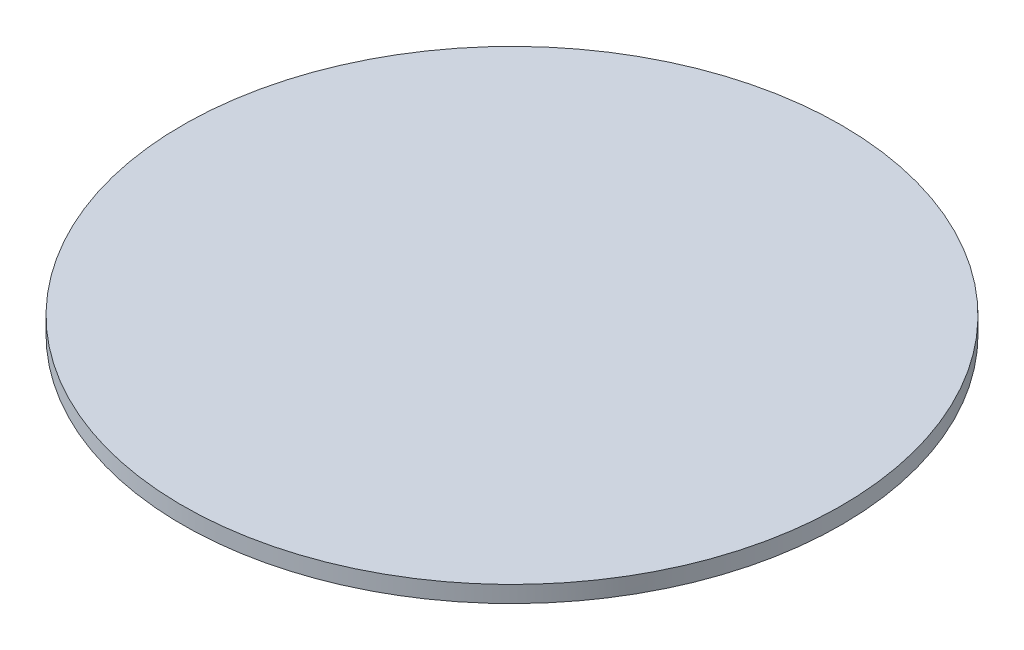
ISO-10303-21;
HEADER;
FILE_DESCRIPTION(('STEP AP214'),'2;1');
FILE_NAME('part.step','',(''),(''),'','','');
FILE_SCHEMA(('AUTOMOTIVE_DESIGN { 1 0 10303 214 1 1 1 1 }'));
ENDSEC;
DATA;
#1=APPLICATION_CONTEXT('core data for automotive mechanical design processes');
#2=APPLICATION_PROTOCOL_DEFINITION('international standard','automotive_design',2000,#1);
#3=PRODUCT_CONTEXT('',#1,'mechanical');
#4=PRODUCT('Part','Part','',(#3));
#5=PRODUCT_RELATED_PRODUCT_CATEGORY('part','',(#4));
#6=PRODUCT_DEFINITION_FORMATION('','',#4);
#7=PRODUCT_DEFINITION_CONTEXT('part definition',#1,'design');
#8=PRODUCT_DEFINITION('design','',#6,#7);
#9=PRODUCT_DEFINITION_SHAPE('','',#8);
#10=(LENGTH_UNIT() NAMED_UNIT(*) SI_UNIT(.MILLI.,.METRE.));
#11=(NAMED_UNIT(*) PLANE_ANGLE_UNIT() SI_UNIT($,.RADIAN.));
#12=(NAMED_UNIT(*) SI_UNIT($,.STERADIAN.) SOLID_ANGLE_UNIT());
#13=UNCERTAINTY_MEASURE_WITH_UNIT(LENGTH_MEASURE(1.E-05),#10,'distance_accuracy_value','');
#14=(GEOMETRIC_REPRESENTATION_CONTEXT(3) GLOBAL_UNCERTAINTY_ASSIGNED_CONTEXT((#13)) GLOBAL_UNIT_ASSIGNED_CONTEXT((#10,
#11,#12)) REPRESENTATION_CONTEXT('',''));
#15=CARTESIAN_POINT('',(0.,0.,0.));
#16=DIRECTION('',(0.,0.,1.));
#17=DIRECTION('',(1.,0.,0.));
#18=AXIS2_PLACEMENT_3D('',#15,#16,#17);
#19=CARTESIAN_POINT('',(21.2731331748166,3.24918533795984,102.377891347207));
#20=CARTESIAN_POINT('',(22.5518424825592,3.24918533795984,102.377891347207));
#21=CARTESIAN_POINT('',(25.1092610980446,3.24918533795984,102.629775095617));
#22=CARTESIAN_POINT('',(28.7979687765083,3.24918533795984,103.748732336676));
#23=CARTESIAN_POINT('',(32.1975012427753,3.24918533795984,105.565820296922));
#24=CARTESIAN_POINT('',(35.177216370647,3.24918533795984,108.011209305078));
#25=CARTESIAN_POINT('',(37.6226053788025,3.24918533795984,110.99092443295));
#26=CARTESIAN_POINT('',(39.4396933390486,3.24918533795984,114.390456899217));
#27=CARTESIAN_POINT('',(40.5586505801075,3.24918533795984,118.07916457768));
#28=CARTESIAN_POINT('',(40.9364762027238,3.24918533795984,121.915292500908));
#29=CARTESIAN_POINT('',(40.5586505801075,3.24918533795984,125.751420424136));
#30=CARTESIAN_POINT('',(39.4396933390486,3.24918533795984,129.4401281026));
#31=CARTESIAN_POINT('',(37.6226053788025,3.24918533795984,132.839660568867));
#32=CARTESIAN_POINT('',(35.177216370647,3.24918533795984,135.819375696739));
#33=CARTESIAN_POINT('',(32.1975012427753,3.24918533795984,138.264764704894));
#34=CARTESIAN_POINT('',(28.7979687765083,3.24918533795984,140.08185266514));
#35=CARTESIAN_POINT('',(25.1092610980446,3.24918533795984,141.200809906199));
#36=CARTESIAN_POINT('',(21.2731331748166,3.24918533795984,141.578635528816));
#37=CARTESIAN_POINT('',(17.4370052515886,3.24918533795984,141.200809906199));
#38=CARTESIAN_POINT('',(13.7482975731249,3.24918533795984,140.08185266514));
#39=CARTESIAN_POINT('',(10.3487651068578,3.24918533795984,138.264764704894));
#40=CARTESIAN_POINT('',(7.36904997898615,3.24918533795984,135.819375696739));
#41=CARTESIAN_POINT('',(4.92366097083058,3.24918533795984,132.839660568867));
#42=CARTESIAN_POINT('',(3.10657301058456,3.24918533795984,129.4401281026));
#43=CARTESIAN_POINT('',(1.98761576952567,3.24918533795984,125.751420424136));
#44=CARTESIAN_POINT('',(1.60979014690934,3.24918533795984,121.915292500908));
#45=CARTESIAN_POINT('',(1.98761576952566,3.24918533795984,118.07916457768));
#46=CARTESIAN_POINT('',(3.10657301058456,3.24918533795984,114.390456899217));
#47=CARTESIAN_POINT('',(4.92366097083058,3.24918533795984,110.99092443295));
#48=CARTESIAN_POINT('',(7.36904997898614,3.24918533795984,108.011209305078));
#49=CARTESIAN_POINT('',(10.3487651068578,3.24918533795984,105.565820296922));
#50=CARTESIAN_POINT('',(13.7482975731249,3.24918533795984,103.748732336676));
#51=CARTESIAN_POINT('',(17.4370052515886,3.24918533795984,102.629775095617));
#52=CARTESIAN_POINT('',(19.9944238670739,3.24918533795984,102.377891347207));
#53=CARTESIAN_POINT('',(21.2731331748166,3.24918533795984,102.377891347207));
#54=B_SPLINE_CURVE_WITH_KNOTS('',3,(#19,#20,#21,#22,#23,#24,#25,#26,#27,#28,#29,#30,#31,#32,#33,
#34,#35,#36,#37,#38,#39,#40,#41,#42,#43,#44,#45,#46,#47,#48,#49,#50,#51,#52,#53),.UNSPECIFIED.,
.T.,.F.,(4,1,1,1,1,1,1,1,1,1,1,1,1,1,1,1,1,1,1,1,1,1,1,1,1,1,1,1,1,1,1,1,4),(0.,
0.0312499999999999,0.0625,0.09375,0.125,0.15625,0.1875,0.21875,0.25,0.28125,0.3125,0.34375,
0.375,0.40625,0.4375,0.46875,0.5,0.53125,0.5625,0.59375,0.625,0.65625,0.6875,0.71875,0.75,
0.78125,0.8125,0.84375,0.875,0.90625,0.9375,0.96875,1.),.UNSPECIFIED.);
#55=DIRECTION('',(0.,-1.,0.));
#56=VECTOR('',#55,1.);
#57=SURFACE_OF_LINEAR_EXTRUSION('',#54,#56);
#58=CARTESIAN_POINT('',(21.2731331748166,3.24918533795984,102.377891347207));
#59=CARTESIAN_POINT('',(22.5518424825592,3.24918533795984,102.377891347207));
#60=CARTESIAN_POINT('',(25.1092610980446,3.24918533795984,102.629775095617));
#61=CARTESIAN_POINT('',(28.7979687765083,3.24918533795984,103.748732336676));
#62=CARTESIAN_POINT('',(32.1975012427753,3.24918533795984,105.565820296922));
#63=CARTESIAN_POINT('',(35.177216370647,3.24918533795984,108.011209305078));
#64=CARTESIAN_POINT('',(37.6226053788025,3.24918533795984,110.99092443295));
#65=CARTESIAN_POINT('',(39.4396933390486,3.24918533795984,114.390456899217));
#66=CARTESIAN_POINT('',(40.5586505801075,3.24918533795984,118.07916457768));
#67=CARTESIAN_POINT('',(40.9364762027238,3.24918533795984,121.915292500908));
#68=CARTESIAN_POINT('',(40.5586505801075,3.24918533795984,125.751420424136));
#69=CARTESIAN_POINT('',(39.4396933390486,3.24918533795984,129.4401281026));
#70=CARTESIAN_POINT('',(37.6226053788025,3.24918533795984,132.839660568867));
#71=CARTESIAN_POINT('',(35.177216370647,3.24918533795984,135.819375696739));
#72=CARTESIAN_POINT('',(32.1975012427753,3.24918533795984,138.264764704894));
#73=CARTESIAN_POINT('',(28.7979687765083,3.24918533795984,140.08185266514));
#74=CARTESIAN_POINT('',(25.1092610980446,3.24918533795984,141.200809906199));
#75=CARTESIAN_POINT('',(21.2731331748166,3.24918533795984,141.578635528816));
#76=CARTESIAN_POINT('',(17.4370052515886,3.24918533795984,141.200809906199));
#77=CARTESIAN_POINT('',(13.7482975731249,3.24918533795984,140.08185266514));
#78=CARTESIAN_POINT('',(10.3487651068578,3.24918533795984,138.264764704894));
#79=CARTESIAN_POINT('',(7.36904997898615,3.24918533795984,135.819375696739));
#80=CARTESIAN_POINT('',(4.92366097083058,3.24918533795984,132.839660568867));
#81=CARTESIAN_POINT('',(3.10657301058456,3.24918533795984,129.4401281026));
#82=CARTESIAN_POINT('',(1.98761576952567,3.24918533795984,125.751420424136));
#83=CARTESIAN_POINT('',(1.60979014690934,3.24918533795984,121.915292500908));
#84=CARTESIAN_POINT('',(1.98761576952566,3.24918533795984,118.07916457768));
#85=CARTESIAN_POINT('',(3.10657301058456,3.24918533795984,114.390456899217));
#86=CARTESIAN_POINT('',(4.92366097083058,3.24918533795984,110.99092443295));
#87=CARTESIAN_POINT('',(7.36904997898614,3.24918533795984,108.011209305078));
#88=CARTESIAN_POINT('',(10.3487651068578,3.24918533795984,105.565820296922));
#89=CARTESIAN_POINT('',(13.7482975731249,3.24918533795984,103.748732336676));
#90=CARTESIAN_POINT('',(17.4370052515886,3.24918533795984,102.629775095617));
#91=CARTESIAN_POINT('',(19.9944238670739,3.24918533795984,102.377891347207));
#92=CARTESIAN_POINT('',(21.2731331748166,3.24918533795984,102.377891347207));
#93=B_SPLINE_CURVE_WITH_KNOTS('',3,(#58,#59,#60,#61,#62,#63,#64,#65,#66,#67,#68,#69,#70,#71,#72,
#73,#74,#75,#76,#77,#78,#79,#80,#81,#82,#83,#84,#85,#86,#87,#88,#89,#90,#91,#92),.UNSPECIFIED.,
.T.,.F.,(4,1,1,1,1,1,1,1,1,1,1,1,1,1,1,1,1,1,1,1,1,1,1,1,1,1,1,1,1,1,1,1,4),(0.,
0.0312499999999999,0.0625,0.09375,0.125,0.15625,0.1875,0.21875,0.25,0.28125,0.3125,0.34375,
0.375,0.40625,0.4375,0.46875,0.5,0.53125,0.5625,0.59375,0.625,0.65625,0.6875,0.71875,0.75,
0.78125,0.8125,0.84375,0.875,0.90625,0.9375,0.96875,1.),.UNSPECIFIED.);
#94=CARTESIAN_POINT('',(21.2731331748166,3.24918533795984,102.377891347207));
#95=VERTEX_POINT('',#94);
#96=EDGE_CURVE('E9',#95,#95,#93,.T.);
#97=ORIENTED_EDGE('',*,*,#96,.T.);
#98=EDGE_LOOP('',(#97));
#99=FACE_BOUND('',#98,.T.);
#100=CARTESIAN_POINT('',(21.2731331748166,2.26610024094684,102.377891347207));
#101=CARTESIAN_POINT('',(20.9534538849464,2.26610024094684,102.377891413515));
#102=CARTESIAN_POINT('',(20.6337769216615,2.26610024094684,102.385762808348));
#103=CARTESIAN_POINT('',(19.9951907999093,2.26610024094684,102.417172587829));
#104=CARTESIAN_POINT('',(19.6762816474255,2.26610024094684,102.440711094176));
#105=CARTESIAN_POINT('',(19.0399992891781,2.26610024094684,102.503379427095));
#106=CARTESIAN_POINT('',(18.7226260834145,2.26610024094684,102.542509253668));
#107=CARTESIAN_POINT('',(18.0901818096652,2.26610024094684,102.636285079453));
#108=CARTESIAN_POINT('',(17.7751107238161,2.26610024094684,102.690930958136));
#109=CARTESIAN_POINT('',(17.1480398609491,2.26610024094684,102.815663105913));
#110=CARTESIAN_POINT('',(16.8360400839313,2.26610024094684,102.885749375006));
#111=CARTESIAN_POINT('',(16.2158512640616,2.26610024094684,103.041137771615));
#112=CARTESIAN_POINT('',(15.9076622508299,2.26610024094684,103.126440017321));
#113=CARTESIAN_POINT('',(15.2958320512569,2.26610024094684,103.31203667904));
#114=CARTESIAN_POINT('',(14.9921908649155,2.26610024094684,103.412331095052));
#115=CARTESIAN_POINT('',(14.3901935366709,2.26610024094684,103.627688814235));
#116=CARTESIAN_POINT('',(14.0918373537326,2.26610024094684,103.742752002677));
#117=CARTESIAN_POINT('',(13.501149529916,2.26610024094684,103.987422910405));
#118=CARTESIAN_POINT('',(13.2088178890376,2.26610024094684,104.11703062969));
#119=CARTESIAN_POINT('',(12.6308605921862,2.26610024094684,104.390426119311));
#120=CARTESIAN_POINT('',(12.3452349883222,2.26610024094684,104.534213999788));
#121=CARTESIAN_POINT('',(11.7813690479351,2.26610024094684,104.835606624106));
#122=CARTESIAN_POINT('',(11.503128711412,2.26610024094684,104.993211367947));
#123=CARTESIAN_POINT('',(10.9547127995542,2.26610024094684,105.321874901627));
#124=CARTESIAN_POINT('',(10.6845371615907,2.26610024094684,105.492933586949));
#125=CARTESIAN_POINT('',(10.1529321649234,2.26610024094684,105.848140689533));
#126=CARTESIAN_POINT('',(9.89150280621962,2.26610024094684,106.032289106795));
#127=CARTESIAN_POINT('',(9.37798761085564,2.26610024094684,106.413185253903));
#128=CARTESIAN_POINT('',(9.12590184679061,2.26610024094684,106.609933081608));
#129=CARTESIAN_POINT('',(8.63166921647461,2.26610024094684,107.015539319044));
#130=CARTESIAN_POINT('',(8.38952235022364,2.26610024094684,107.224397728775));
#131=CARTESIAN_POINT('',(7.91576317095395,2.26610024094684,107.653736721657));
#132=CARTESIAN_POINT('',(7.68415077611925,2.26610024094684,107.874217214517));
#133=CARTESIAN_POINT('',(7.23205788842505,2.26610024094684,108.326310102211));
#134=CARTESIAN_POINT('',(7.01157739556555,2.26610024094684,108.557922497046));
#135=CARTESIAN_POINT('',(6.5822384026831,2.26610024094684,109.031681676315));
#136=CARTESIAN_POINT('',(6.37337999295179,2.26610024094684,109.273828542566));
#137=CARTESIAN_POINT('',(5.967773755516,2.26610024094684,109.768061172882));
#138=CARTESIAN_POINT('',(5.77102592781153,2.26610024094684,110.020146936947));
#139=CARTESIAN_POINT('',(5.39012978070341,2.26610024094684,110.533662132311));
#140=CARTESIAN_POINT('',(5.20598136344083,2.26610024094684,110.795091491015));
#141=CARTESIAN_POINT('',(4.85077426085684,2.26610024094684,111.326696487682));
#142=CARTESIAN_POINT('',(4.67971557553542,2.26610024094684,111.596872125645));
#143=CARTESIAN_POINT('',(4.35105204185499,2.26610024094684,112.145288037504));
#144=CARTESIAN_POINT('',(4.19344729801418,2.26610024094684,112.423528374029));
#145=CARTESIAN_POINT('',(3.89205467369665,2.26610024094684,112.987394314411));
#146=CARTESIAN_POINT('',(3.74826679321992,2.26610024094684,113.273019918268));
#147=CARTESIAN_POINT('',(3.47487130359773,2.26610024094684,113.850977215139));
#148=CARTESIAN_POINT('',(3.34526358431105,2.26610024094684,114.143308856043));
#149=CARTESIAN_POINT('',(3.10059267658712,2.26610024094684,114.733996679789));
#150=CARTESIAN_POINT('',(2.98552948814987,2.26610024094684,115.032352862629));
#151=CARTESIAN_POINT('',(2.77017176895415,2.26610024094684,115.63435019114));
#152=CARTESIAN_POINT('',(2.66987735292391,2.26610024094684,115.937991377846));
#153=CARTESIAN_POINT('',(2.48428069125422,2.26610024094684,116.549821576424));
#154=CARTESIAN_POINT('',(2.39897844561477,2.26610024094684,116.858010588298));
#155=CARTESIAN_POINT('',(2.24359004882273,2.26610024094684,117.478199411878));
#156=CARTESIAN_POINT('',(2.17350377947929,2.26610024094684,117.790199193965));
#157=CARTESIAN_POINT('',(2.04877163238623,2.26610024094684,118.417270042984));
#158=CARTESIAN_POINT('',(1.99412575463661,2.26610024094684,118.732341109916));
#159=CARTESIAN_POINT('',(1.90034992630031,2.26610024094684,119.364785435348));
#160=CARTESIAN_POINT('',(1.86122009624291,2.26610024094684,119.682158711712));
#161=CARTESIAN_POINT('',(1.79855177284522,2.26610024094684,120.318440877075));
#162=CARTESIAN_POINT('',(1.77501327950494,2.26610024094684,120.637349766073));
#163=CARTESIAN_POINT('',(1.74360346448895,2.26610024094684,121.275936607679));
#164=CARTESIAN_POINT('',(1.73573202111478,2.26610024094684,121.595614554294));
#165=CARTESIAN_POINT('',(1.73573202111478,2.26610024094684,122.234970447523));
#166=CARTESIAN_POINT('',(1.74360346448895,2.26610024094684,122.554648394138));
#167=CARTESIAN_POINT('',(1.77501327950494,2.26610024094684,123.193235235744));
#168=CARTESIAN_POINT('',(1.79855177284523,2.26610024094684,123.512144124742));
#169=CARTESIAN_POINT('',(1.86122009624291,2.26610024094684,124.148426290104));
#170=CARTESIAN_POINT('',(1.90034992630031,2.26610024094684,124.465799566469));
#171=CARTESIAN_POINT('',(1.99412575463661,2.26610024094684,125.098243891901));
#172=CARTESIAN_POINT('',(2.04877163238623,2.26610024094684,125.413314958833));
#173=CARTESIAN_POINT('',(2.17350377947929,2.26610024094684,126.040385807852));
#174=CARTESIAN_POINT('',(2.24359004882273,2.26610024094684,126.352385589938));
#175=CARTESIAN_POINT('',(2.39897844561477,2.26610024094684,126.972574413519));
#176=CARTESIAN_POINT('',(2.48428069125422,2.26610024094684,127.280763425392));
#177=CARTESIAN_POINT('',(2.66987735292391,2.26610024094684,127.892593623971));
#178=CARTESIAN_POINT('',(2.77017176895415,2.26610024094684,128.196234810676));
#179=CARTESIAN_POINT('',(2.98552948814986,2.26610024094684,128.798232139187));
#180=CARTESIAN_POINT('',(3.10059267658712,2.26610024094684,129.096588322028));
#181=CARTESIAN_POINT('',(3.34526358431105,2.26610024094684,129.687276145773));
#182=CARTESIAN_POINT('',(3.47487130359772,2.26610024094684,129.979607786678));
#183=CARTESIAN_POINT('',(3.74826679321991,2.26610024094684,130.557565083548));
#184=CARTESIAN_POINT('',(3.89205467369665,2.26610024094684,130.843190687405));
#185=CARTESIAN_POINT('',(4.19344729801418,2.26610024094684,131.407056627787));
#186=CARTESIAN_POINT('',(4.35105204185498,2.26610024094684,131.685296964312));
#187=CARTESIAN_POINT('',(4.67971557553541,2.26610024094684,132.233712876171));
#188=CARTESIAN_POINT('',(4.85077426085683,2.26610024094684,132.503888514134));
#189=CARTESIAN_POINT('',(5.20598136344083,2.26610024094684,133.035493510801));
#190=CARTESIAN_POINT('',(5.39012978070341,2.26610024094684,133.296922869505));
#191=CARTESIAN_POINT('',(5.77102592781152,2.26610024094684,133.810438064869));
#192=CARTESIAN_POINT('',(5.96777375551599,2.26610024094684,134.062523828934));
#193=CARTESIAN_POINT('',(6.37337999295178,2.26610024094684,134.55675645925));
#194=CARTESIAN_POINT('',(6.5822384026831,2.26610024094684,134.798903325501));
#195=CARTESIAN_POINT('',(7.01157739556555,2.26610024094684,135.272662504771));
#196=CARTESIAN_POINT('',(7.23205788842504,2.26610024094684,135.504274899606));
#197=CARTESIAN_POINT('',(7.68415077611924,2.26610024094684,135.9563677873));
#198=CARTESIAN_POINT('',(7.91576317095394,2.26610024094684,136.176848280159));
#199=CARTESIAN_POINT('',(8.38952235022364,2.26610024094684,136.606187273042));
#200=CARTESIAN_POINT('',(8.63166921647462,2.26610024094684,136.815045682773));
#201=CARTESIAN_POINT('',(9.12590184679059,2.26610024094684,137.220651920209));
#202=CARTESIAN_POINT('',(9.37798761085558,2.26610024094684,137.417399747913));
#203=CARTESIAN_POINT('',(9.89150280621966,2.26610024094684,137.798295895021));
#204=CARTESIAN_POINT('',(10.1529321649235,2.26610024094684,137.982444312284));
#205=CARTESIAN_POINT('',(10.6845371615905,2.26610024094684,138.337651414868));
#206=CARTESIAN_POINT('',(10.9547127995535,2.26610024094684,138.508710100189));
#207=CARTESIAN_POINT('',(11.5031287114127,2.26610024094684,138.83737363387));
#208=CARTESIAN_POINT('',(11.7813690479376,2.26610024094684,138.994978377711));
#209=CARTESIAN_POINT('',(12.3452349883196,2.26610024094684,139.296371002028));
#210=CARTESIAN_POINT('',(12.6308605921766,2.26610024094684,139.440158882505));
#211=CARTESIAN_POINT('',(13.2088178890471,2.26610024094684,139.713554372127));
#212=CARTESIAN_POINT('',(13.5011495299517,2.26610024094684,139.843162091414));
#213=CARTESIAN_POINT('',(14.0918373536969,2.26610024094684,140.087832999138));
#214=CARTESIAN_POINT('',(14.3901935365376,2.26610024094684,140.202896187575));
#215=CARTESIAN_POINT('',(14.9921908650487,2.26610024094684,140.418253906771));
#216=CARTESIAN_POINT('',(15.295832051754,2.26610024094684,140.518548322801));
#217=CARTESIAN_POINT('',(15.9076622503328,2.26610024094684,140.704144984471));
#218=CARTESIAN_POINT('',(16.2158512622062,2.26610024094684,140.78944723011));
#219=CARTESIAN_POINT('',(16.8360400857866,2.26610024094684,140.944835626902));
#220=CARTESIAN_POINT('',(17.1480398678733,2.26610024094684,141.014921896246));
#221=CARTESIAN_POINT('',(17.7751107168919,2.26610024094684,141.139654043339));
#222=CARTESIAN_POINT('',(18.0901817838238,2.26610024094684,141.194299921088));
#223=CARTESIAN_POINT('',(18.722626109256,2.26610024094684,141.288075749425));
#224=CARTESIAN_POINT('',(19.0399993856206,2.26610024094684,141.327205579482));
#225=CARTESIAN_POINT('',(19.676281550983,2.26610024094684,141.38987390288));
#226=CARTESIAN_POINT('',(19.995190439981,2.26610024094684,141.41341239622));
#227=CARTESIAN_POINT('',(20.633777281587,2.26610024094684,141.444822211236));
#228=CARTESIAN_POINT('',(20.9534552282018,2.26610024094684,141.45269365461));
#229=CARTESIAN_POINT('',(21.5928111214313,2.26610024094684,141.45269365461));
#230=CARTESIAN_POINT('',(21.9124890680461,2.26610024094684,141.444822211236));
#231=CARTESIAN_POINT('',(22.5510759096521,2.26610024094684,141.41341239622));
#232=CARTESIAN_POINT('',(22.86998479865,2.26610024094684,141.38987390288));
#233=CARTESIAN_POINT('',(23.5062669640125,2.26610024094684,141.327205579482));
#234=CARTESIAN_POINT('',(23.823640240377,2.26610024094684,141.288075749425));
#235=CARTESIAN_POINT('',(24.4560845658093,2.26610024094684,141.194299921088));
#236=CARTESIAN_POINT('',(24.7711556327412,2.26610024094684,141.139654043339));
#237=CARTESIAN_POINT('',(25.3982264817598,2.26610024094684,141.014921896246));
#238=CARTESIAN_POINT('',(25.7102262638465,2.26610024094684,140.944835626902));
#239=CARTESIAN_POINT('',(26.3304150874269,2.26610024094684,140.78944723011));
#240=CARTESIAN_POINT('',(26.6386040993003,2.26610024094684,140.704144984471));
#241=CARTESIAN_POINT('',(27.2504342978791,2.26610024094684,140.518548322801));
#242=CARTESIAN_POINT('',(27.5540754845844,2.26610024094684,140.418253906771));
#243=CARTESIAN_POINT('',(28.1560728130955,2.26610024094684,140.202896187575));
#244=CARTESIAN_POINT('',(28.4544289959362,2.26610024094684,140.087832999138));
#245=CARTESIAN_POINT('',(29.0451168196814,2.26610024094684,139.843162091414));
#246=CARTESIAN_POINT('',(29.337448460586,2.26610024094684,139.713554372127));
#247=CARTESIAN_POINT('',(29.9154057574565,2.26610024094684,139.440158882505));
#248=CARTESIAN_POINT('',(30.2010313613135,2.26610024094684,139.296371002028));
#249=CARTESIAN_POINT('',(30.7648973016954,2.26610024094684,138.994978377711));
#250=CARTESIAN_POINT('',(31.0431376382204,2.26610024094684,138.83737363387));
#251=CARTESIAN_POINT('',(31.5915535500796,2.26610024094684,138.508710100189));
#252=CARTESIAN_POINT('',(31.8617291880426,2.26610024094684,138.337651414868));
#253=CARTESIAN_POINT('',(32.3933341847096,2.26610024094684,137.982444312284));
#254=CARTESIAN_POINT('',(32.6547635434134,2.26610024094684,137.798295895021));
#255=CARTESIAN_POINT('',(33.1682787387775,2.26610024094684,137.417399747913));
#256=CARTESIAN_POINT('',(33.4203645028425,2.26610024094684,137.220651920209));
#257=CARTESIAN_POINT('',(33.9145971331585,2.26610024094684,136.815045682773));
#258=CARTESIAN_POINT('',(34.1567439994095,2.26610024094684,136.606187273042));
#259=CARTESIAN_POINT('',(34.6305031786791,2.26610024094684,136.176848280159));
#260=CARTESIAN_POINT('',(34.8621155735139,2.26610024094684,135.9563677873));
#261=CARTESIAN_POINT('',(35.3142084612081,2.26610024094684,135.504274899606));
#262=CARTESIAN_POINT('',(35.5346889540676,2.26610024094684,135.272662504771));
#263=CARTESIAN_POINT('',(35.96402794695,2.26610024094684,134.798903325501));
#264=CARTESIAN_POINT('',(36.1728863566813,2.26610024094684,134.55675645925));
#265=CARTESIAN_POINT('',(36.5784925941171,2.26610024094684,134.062523828934));
#266=CARTESIAN_POINT('',(36.7752404218216,2.26610024094684,133.810438064869));
#267=CARTESIAN_POINT('',(37.1561365689297,2.26610024094684,133.296922869505));
#268=CARTESIAN_POINT('',(37.3402849861923,2.26610024094684,133.035493510801));
#269=CARTESIAN_POINT('',(37.6954920887763,2.26610024094684,132.503888514134));
#270=CARTESIAN_POINT('',(37.8665507740977,2.26610024094684,132.233712876171));
#271=CARTESIAN_POINT('',(38.1952143077781,2.26610024094684,131.685296964312));
#272=CARTESIAN_POINT('',(38.3528190516189,2.26610024094684,131.407056627787));
#273=CARTESIAN_POINT('',(38.6542116759365,2.26610024094684,130.843190687405));
#274=CARTESIAN_POINT('',(38.7979995564132,2.26610024094684,130.557565083548));
#275=CARTESIAN_POINT('',(39.0713950460354,2.26610024094684,129.979607786678));
#276=CARTESIAN_POINT('',(39.2010027653221,2.26610024094684,129.687276145773));
#277=CARTESIAN_POINT('',(39.445673673046,2.26610024094684,129.096588322028));
#278=CARTESIAN_POINT('',(39.5607368614833,2.26610024094684,128.798232139187));
#279=CARTESIAN_POINT('',(39.776094580679,2.26610024094684,128.196234810676));
#280=CARTESIAN_POINT('',(39.8763889967092,2.26610024094684,127.892593623971));
#281=CARTESIAN_POINT('',(40.0619856583789,2.26610024094684,127.280763425392));
#282=CARTESIAN_POINT('',(40.1472879040184,2.26610024094684,126.972574413519));
#283=CARTESIAN_POINT('',(40.3026763008104,2.26610024094684,126.352385589938));
#284=CARTESIAN_POINT('',(40.3727625701538,2.26610024094684,126.040385807852));
#285=CARTESIAN_POINT('',(40.4974947172469,2.26610024094684,125.413314958833));
#286=CARTESIAN_POINT('',(40.5521405949965,2.26610024094684,125.098243891901));
#287=CARTESIAN_POINT('',(40.6459164233328,2.26610024094684,124.465799566469));
#288=CARTESIAN_POINT('',(40.6850462533902,2.26610024094684,124.148426290104));
#289=CARTESIAN_POINT('',(40.7477145767879,2.26610024094684,123.512144124742));
#290=CARTESIAN_POINT('',(40.7712530701282,2.26610024094684,123.193235235744));
#291=CARTESIAN_POINT('',(40.8026628851442,2.26610024094684,122.554648394138));
#292=CARTESIAN_POINT('',(40.8105343285183,2.26610024094684,122.234970447523));
#293=CARTESIAN_POINT('',(40.8105343285183,2.26610024094684,121.595614554294));
#294=CARTESIAN_POINT('',(40.8026628851442,2.26610024094684,121.275936607679));
#295=CARTESIAN_POINT('',(40.7712530701282,2.26610024094684,120.637349766073));
#296=CARTESIAN_POINT('',(40.7477145767879,2.26610024094684,120.318440877075));
#297=CARTESIAN_POINT('',(40.6850462533902,2.26610024094684,119.682158711712));
#298=CARTESIAN_POINT('',(40.6459164233328,2.26610024094684,119.364785435348));
#299=CARTESIAN_POINT('',(40.5521405949965,2.26610024094684,118.732341109916));
#300=CARTESIAN_POINT('',(40.4974947172469,2.26610024094684,118.417270042984));
#301=CARTESIAN_POINT('',(40.3727625701538,2.26610024094684,117.790199193965));
#302=CARTESIAN_POINT('',(40.3026763008104,2.26610024094684,117.478199411878));
#303=CARTESIAN_POINT('',(40.1472879040184,2.26610024094684,116.858010588298));
#304=CARTESIAN_POINT('',(40.0619856583789,2.26610024094684,116.549821576425));
#305=CARTESIAN_POINT('',(39.8763889967092,2.26610024094684,115.937991377846));
#306=CARTESIAN_POINT('',(39.776094580679,2.26610024094684,115.63435019114));
#307=CARTESIAN_POINT('',(39.5607368614833,2.26610024094684,115.032352862629));
#308=CARTESIAN_POINT('',(39.445673673046,2.26610024094684,114.733996679789));
#309=CARTESIAN_POINT('',(39.2010027653221,2.26610024094684,114.143308856043));
#310=CARTESIAN_POINT('',(39.0713950460354,2.26610024094684,113.850977215139));
#311=CARTESIAN_POINT('',(38.7979995564132,2.26610024094684,113.273019918268));
#312=CARTESIAN_POINT('',(38.6542116759365,2.26610024094684,112.987394314411));
#313=CARTESIAN_POINT('',(38.3528190516189,2.26610024094684,112.423528374029));
#314=CARTESIAN_POINT('',(38.1952143077781,2.26610024094684,112.145288037504));
#315=CARTESIAN_POINT('',(37.8665507740977,2.26610024094684,111.596872125645));
#316=CARTESIAN_POINT('',(37.6954920887763,2.26610024094684,111.326696487682));
#317=CARTESIAN_POINT('',(37.3402849861923,2.26610024094684,110.795091491015));
#318=CARTESIAN_POINT('',(37.1561365689297,2.26610024094684,110.533662132311));
#319=CARTESIAN_POINT('',(36.7752404218216,2.26610024094684,110.020146936947));
#320=CARTESIAN_POINT('',(36.5784925941171,2.26610024094684,109.768061172882));
#321=CARTESIAN_POINT('',(36.1728863566813,2.26610024094684,109.273828542566));
#322=CARTESIAN_POINT('',(35.96402794695,2.26610024094684,109.031681676315));
#323=CARTESIAN_POINT('',(35.5346889540676,2.26610024094684,108.557922497046));
#324=CARTESIAN_POINT('',(35.3142084612081,2.26610024094684,108.326310102211));
#325=CARTESIAN_POINT('',(34.8621155735139,2.26610024094684,107.874217214517));
#326=CARTESIAN_POINT('',(34.6305031786792,2.26610024094684,107.653736721657));
#327=CARTESIAN_POINT('',(34.1567439994095,2.26610024094684,107.224397728775));
#328=CARTESIAN_POINT('',(33.9145971331585,2.26610024094684,107.015539319044));
#329=CARTESIAN_POINT('',(33.4203645028425,2.26610024094684,106.609933081608));
#330=CARTESIAN_POINT('',(33.1682787387775,2.26610024094684,106.413185253903));
#331=CARTESIAN_POINT('',(32.6547635434135,2.26610024094684,106.032289106795));
#332=CARTESIAN_POINT('',(32.3933341847098,2.26610024094684,105.848140689533));
#333=CARTESIAN_POINT('',(31.8617291880425,2.26610024094684,105.492933586949));
#334=CARTESIAN_POINT('',(31.5915535500789,2.26610024094684,105.321874901627));
#335=CARTESIAN_POINT('',(31.0431376382211,2.26610024094684,104.993211367947));
#336=CARTESIAN_POINT('',(30.764897301698,2.26610024094684,104.835606624106));
#337=CARTESIAN_POINT('',(30.2010313613109,2.26610024094684,104.534213999788));
#338=CARTESIAN_POINT('',(29.9154057574469,2.26610024094684,104.390426119311));
#339=CARTESIAN_POINT('',(29.3374484605955,2.26610024094684,104.11703062969));
#340=CARTESIAN_POINT('',(29.0451168197172,2.26610024094684,103.987422910405));
#341=CARTESIAN_POINT('',(28.4544289959005,2.26610024094684,103.742752002677));
#342=CARTESIAN_POINT('',(28.1560728129623,2.26610024094684,103.627688814235));
#343=CARTESIAN_POINT('',(27.5540754847176,2.26610024094684,103.412331095052));
#344=CARTESIAN_POINT('',(27.2504342983763,2.26610024094684,103.31203667904));
#345=CARTESIAN_POINT('',(26.6386040988032,2.26610024094684,103.126440017321));
#346=CARTESIAN_POINT('',(26.3304150855716,2.26610024094684,103.041137771615));
#347=CARTESIAN_POINT('',(25.7102262657019,2.26610024094684,102.885749375006));
#348=CARTESIAN_POINT('',(25.398226488684,2.26610024094684,102.815663105913));
#349=CARTESIAN_POINT('',(24.771155625817,2.26610024094684,102.690930958136));
#350=CARTESIAN_POINT('',(24.4560845399679,2.26610024094684,102.636285079453));
#351=CARTESIAN_POINT('',(23.8236402662187,2.26610024094684,102.542509253668));
#352=CARTESIAN_POINT('',(23.506267060455,2.26610024094684,102.503379427095));
#353=CARTESIAN_POINT('',(22.8699847022076,2.26610024094684,102.440711094176));
#354=CARTESIAN_POINT('',(22.5510755497238,2.26610024094684,102.417172587829));
#355=CARTESIAN_POINT('',(21.9124894279716,2.26610024094684,102.385762808348));
#356=CARTESIAN_POINT('',(21.5928124646867,2.26610024094684,102.377891413515));
#357=CARTESIAN_POINT('',(21.2731331748166,2.26610024094684,102.377891347207));
#358=B_SPLINE_CURVE_WITH_KNOTS('',3,(#100,#101,#102,#103,#104,#105,#106,#107,#108,#109,#110,
#111,#112,#113,#114,#115,#116,#117,#118,#119,#120,#121,#122,#123,#124,#125,#126,#127,#128,#129,
#130,#131,#132,#133,#134,#135,#136,#137,#138,#139,#140,#141,#142,#143,#144,#145,#146,#147,#148,
#149,#150,#151,#152,#153,#154,#155,#156,#157,#158,#159,#160,#161,#162,#163,#164,#165,#166,#167,
#168,#169,#170,#171,#172,#173,#174,#175,#176,#177,#178,#179,#180,#181,#182,#183,#184,#185,#186,
#187,#188,#189,#190,#191,#192,#193,#194,#195,#196,#197,#198,#199,#200,#201,#202,#203,#204,#205,
#206,#207,#208,#209,#210,#211,#212,#213,#214,#215,#216,#217,#218,#219,#220,#221,#222,#223,#224,
#225,#226,#227,#228,#229,#230,#231,#232,#233,#234,#235,#236,#237,#238,#239,#240,#241,#242,#243,
#244,#245,#246,#247,#248,#249,#250,#251,#252,#253,#254,#255,#256,#257,#258,#259,#260,#261,#262,
#263,#264,#265,#266,#267,#268,#269,#270,#271,#272,#273,#274,#275,#276,#277,#278,#279,#280,#281,
#282,#283,#284,#285,#286,#287,#288,#289,#290,#291,#292,#293,#294,#295,#296,#297,#298,#299,#300,
#301,#302,#303,#304,#305,#306,#307,#308,#309,#310,#311,#312,#313,#314,#315,#316,#317,#318,#319,
#320,#321,#322,#323,#324,#325,#326,#327,#328,#329,#330,#331,#332,#333,#334,#335,#336,#337,#338,
#339,#340,#341,#342,#343,#344,#345,#346,#347,#348,#349,#350,#351,#352,#353,#354,#355,#356,#357),
.UNSPECIFIED.,.F.,.F.,(4,2,2,2,2,2,2,2,2,2,2,2,2,2,2,2,2,2,2,2,2,2,2,2,2,2,2,2,2,2,2,2,2,2,2,2,
2,2,2,2,2,2,2,2,2,2,2,2,2,2,2,2,2,2,2,2,2,2,2,2,2,2,2,2,2,2,2,2,2,2,2,2,2,2,2,2,2,2,2,2,2,2,2,2,
2,2,2,2,2,2,2,2,2,2,2,2,2,2,2,2,2,2,2,2,2,2,2,2,2,2,2,2,2,2,2,2,2,2,2,2,2,2,2,2,2,2,2,2,4),(0.,
0.958937939115206,1.91788332715285,2.87682871519048,3.83576665430568,4.79470459342088,
5.75364998145852,6.71259536949616,7.67153330861136,8.63047124772657,9.58941663576422,
10.5483620238019,11.5072999629171,12.4662379020323,13.4251832900699,14.3841286781075,
15.3430666172227,16.3020045563379,17.2609499443756,18.2198953324132,19.1788332715284,
20.1377712106436,21.0967165986813,22.0556619867189,23.0145999258341,23.9735378649493,
24.9324832529869,25.8914286410246,26.8503665801398,27.809304519255,28.7682499072926,
29.7271952953302,30.6861332344454,31.6450711735606,32.6040165615983,33.5629619496359,
34.5218998887511,35.4808378278664,36.439783215904,37.3987286039416,38.3576665430568,
39.3166044821721,40.2755498702097,41.2344952582473,42.1934331973625,43.1523711364777,
44.1113165245154,45.070261912553,46.0291998516682,46.9881377907834,47.947083178821,
48.9060285668587,49.8649665059739,50.8239044450891,51.7828498331267,52.7417952211644,
53.7007331602796,54.6596710993948,55.6186164874324,56.57756187547,57.5364998145852,
58.4954377537005,59.4543831417381,60.4133285297757,61.3722664688909,62.3312044080061,
63.2901497960438,64.2490951840814,65.2080331231966,66.1669710623118,67.1259164503495,
68.0848618383871,69.0437997775023,70.0027377166175,70.9616831046551,71.9206284926928,
72.879566431808,73.8385043709232,74.7974497589608,75.7563951469985,76.7153330861137,
77.6742710252289,78.6332164132665,79.5921618013042,80.5510997404193,81.5100376795346,
82.4689830675722,83.4279284556099,84.3868663947251,85.3458043338403,86.3047497218779,
87.2636951099155,88.2226330490307,89.1815709881459,90.1405163761835,91.0994617642212,
92.0583997033364,93.0173376424516,93.9762830304893,94.9352284185269,95.8941663576421,
96.8531042967573,97.812049684795,98.7709950728326,99.7299330119478,100.688870951063,
101.647816339101,102.606761727138,103.565699666253,104.524637605369,105.483582993406,
106.442528381444,107.401466320559,108.360404259674,109.319349647712,110.27829503575,
111.237232974865,112.19617091398,113.155116302018,114.114061690055,115.07299962917,
116.031937568286,116.990882956323,117.949828344361,118.908766283476,119.867704222591,
120.826649610629,121.785594998667,122.744532937782),.UNSPECIFIED.);
#359=CARTESIAN_POINT('',(21.2731331748166,2.26610024094684,102.377891347207));
#360=VERTEX_POINT('',#359);
#361=EDGE_CURVE('E24',#360,#360,#358,.F.);
#362=ORIENTED_EDGE('',*,*,#361,.F.);
#363=EDGE_LOOP('',(#362));
#364=FACE_BOUND('',#363,.T.);
#365=ADVANCED_FACE('F14',(#99,#364),#57,.T.);
#366=CARTESIAN_POINT('',(59.0486320515158,3.24918533795985,92.8386717783556));
#367=DIRECTION('',(0.,-1.,0.));
#368=DIRECTION('',(1.,0.,0.));
#369=AXIS2_PLACEMENT_3D('',#366,#367,#368);
#370=PLANE('',#369);
#371=ORIENTED_EDGE('',*,*,#96,.F.);
#372=EDGE_LOOP('',(#371));
#373=FACE_BOUND('',#372,.T.);
#374=ADVANCED_FACE('F62',(#373),#370,.F.);
#375=CARTESIAN_POINT('',(59.0486320515158,2.26610024094684,92.8386717783556));
#376=DIRECTION('',(0.,-1.,0.));
#377=DIRECTION('',(1.,0.,0.));
#378=AXIS2_PLACEMENT_3D('',#375,#376,#377);
#379=PLANE('',#378);
#380=ORIENTED_EDGE('',*,*,#361,.T.);
#381=EDGE_LOOP('',(#380));
#382=FACE_BOUND('',#381,.T.);
#383=ADVANCED_FACE('F31',(#382),#379,.T.);
#384=CLOSED_SHELL('',(#365,#374,#383));
#385=MANIFOLD_SOLID_BREP('B1',#384);
#386=ADVANCED_BREP_SHAPE_REPRESENTATION('',(#18,#385),#14);
#387=SHAPE_DEFINITION_REPRESENTATION(#9,#386);
ENDSEC;
END-ISO-10303-21;
